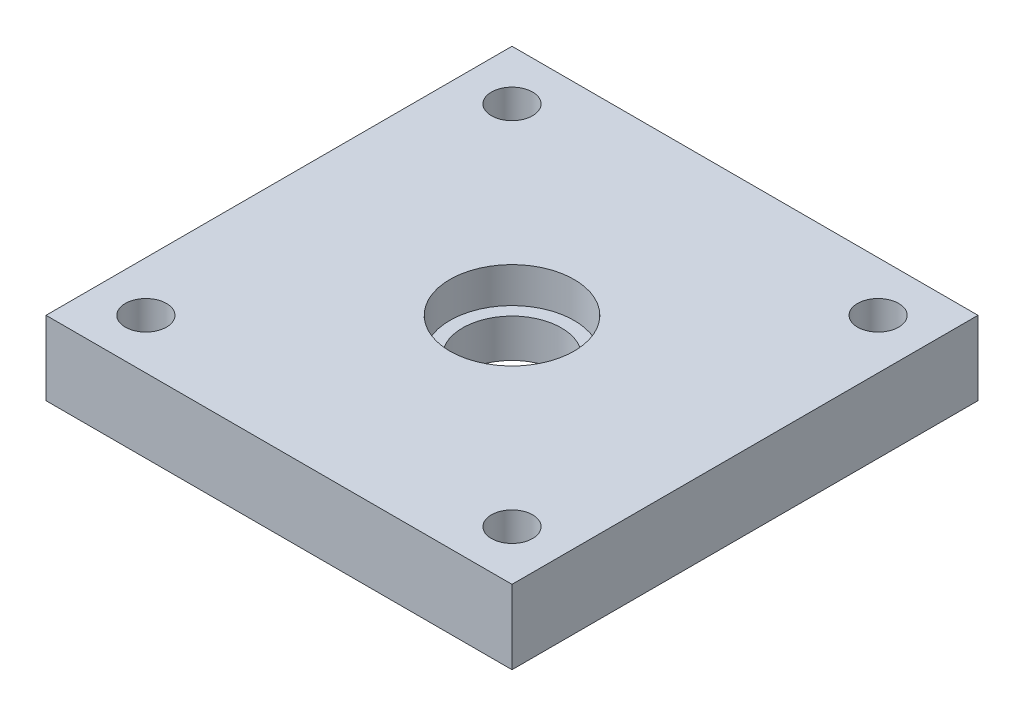
ISO-10303-21;
HEADER;
FILE_DESCRIPTION(('STEP AP214'),'2;1');
FILE_NAME('part.step','',(''),(''),'','','');
FILE_SCHEMA(('AUTOMOTIVE_DESIGN { 1 0 10303 214 1 1 1 1 }'));
ENDSEC;
DATA;
#1=APPLICATION_CONTEXT('core data for automotive mechanical design processes');
#2=APPLICATION_PROTOCOL_DEFINITION('international standard','automotive_design',2000,#1);
#3=PRODUCT_CONTEXT('',#1,'mechanical');
#4=PRODUCT('Part','Part','',(#3));
#5=PRODUCT_RELATED_PRODUCT_CATEGORY('part','',(#4));
#6=PRODUCT_DEFINITION_FORMATION('','',#4);
#7=PRODUCT_DEFINITION_CONTEXT('part definition',#1,'design');
#8=PRODUCT_DEFINITION('design','',#6,#7);
#9=PRODUCT_DEFINITION_SHAPE('','',#8);
#10=(LENGTH_UNIT() NAMED_UNIT(*) SI_UNIT(.MILLI.,.METRE.));
#11=(NAMED_UNIT(*) PLANE_ANGLE_UNIT() SI_UNIT($,.RADIAN.));
#12=(NAMED_UNIT(*) SI_UNIT($,.STERADIAN.) SOLID_ANGLE_UNIT());
#13=UNCERTAINTY_MEASURE_WITH_UNIT(LENGTH_MEASURE(1.E-05),#10,'distance_accuracy_value','');
#14=(GEOMETRIC_REPRESENTATION_CONTEXT(3) GLOBAL_UNCERTAINTY_ASSIGNED_CONTEXT((#13)) GLOBAL_UNIT_ASSIGNED_CONTEXT((#10,
#11,#12)) REPRESENTATION_CONTEXT('',''));
#15=CARTESIAN_POINT('',(0.,0.,0.));
#16=DIRECTION('',(0.,0.,1.));
#17=DIRECTION('',(1.,0.,0.));
#18=AXIS2_PLACEMENT_3D('',#15,#16,#17);
#19=CARTESIAN_POINT('',(30.,9.525,-30.));
#20=DIRECTION('',(-1.,0.,0.));
#21=DIRECTION('',(0.,0.,1.));
#22=AXIS2_PLACEMENT_3D('',#19,#20,#21);
#23=PLANE('',#22);
#24=DIRECTION('',(0.,0.,-1.));
#25=VECTOR('',#24,1.);
#26=CARTESIAN_POINT('',(30.,0.,-30.));
#27=LINE('',#26,#25);
#28=CARTESIAN_POINT('',(30.,0.,30.));
#29=VERTEX_POINT('',#28);
#30=CARTESIAN_POINT('',(30.,0.,-30.));
#31=VERTEX_POINT('',#30);
#32=EDGE_CURVE('E95',#29,#31,#27,.T.);
#33=ORIENTED_EDGE('',*,*,#32,.T.);
#34=DIRECTION('',(0.,-1.,0.));
#35=VECTOR('',#34,1.);
#36=CARTESIAN_POINT('',(30.,9.525,-30.));
#37=LINE('',#36,#35);
#38=CARTESIAN_POINT('',(30.,9.525,-30.));
#39=VERTEX_POINT('',#38);
#40=EDGE_CURVE('E11',#39,#31,#37,.T.);
#41=ORIENTED_EDGE('',*,*,#40,.F.);
#42=DIRECTION('',(0.,0.,-1.));
#43=VECTOR('',#42,1.);
#44=CARTESIAN_POINT('',(30.,9.525,-30.));
#45=LINE('',#44,#43);
#46=CARTESIAN_POINT('',(30.,9.525,30.));
#47=VERTEX_POINT('',#46);
#48=EDGE_CURVE('E83',#47,#39,#45,.T.);
#49=ORIENTED_EDGE('',*,*,#48,.F.);
#50=DIRECTION('',(0.,-1.,0.));
#51=VECTOR('',#50,1.);
#52=CARTESIAN_POINT('',(30.,9.525,30.));
#53=LINE('',#52,#51);
#54=EDGE_CURVE('E91',#47,#29,#53,.T.);
#55=ORIENTED_EDGE('',*,*,#54,.T.);
#56=EDGE_LOOP('',(#33,#41,#49,#55));
#57=FACE_BOUND('',#56,.T.);
#58=ADVANCED_FACE('F32',(#57),#23,.F.);
#59=CARTESIAN_POINT('',(-30.,9.525,-30.));
#60=DIRECTION('',(0.,0.,1.));
#61=DIRECTION('',(1.,0.,0.));
#62=AXIS2_PLACEMENT_3D('',#59,#60,#61);
#63=PLANE('',#62);
#64=DIRECTION('',(-1.,0.,0.));
#65=VECTOR('',#64,1.);
#66=CARTESIAN_POINT('',(-30.,0.,-30.));
#67=LINE('',#66,#65);
#68=CARTESIAN_POINT('',(-30.,0.,-30.));
#69=VERTEX_POINT('',#68);
#70=EDGE_CURVE('E87',#31,#69,#67,.T.);
#71=ORIENTED_EDGE('',*,*,#70,.T.);
#72=DIRECTION('',(0.,-1.,0.));
#73=VECTOR('',#72,1.);
#74=CARTESIAN_POINT('',(-30.,9.525,-30.));
#75=LINE('',#74,#73);
#76=CARTESIAN_POINT('',(-30.,9.525,-30.));
#77=VERTEX_POINT('',#76);
#78=EDGE_CURVE('E40',#77,#69,#75,.T.);
#79=ORIENTED_EDGE('',*,*,#78,.F.);
#80=DIRECTION('',(-1.,0.,0.));
#81=VECTOR('',#80,1.);
#82=CARTESIAN_POINT('',(-30.,9.525,-30.));
#83=LINE('',#82,#81);
#84=EDGE_CURVE('E78',#39,#77,#83,.T.);
#85=ORIENTED_EDGE('',*,*,#84,.F.);
#86=ORIENTED_EDGE('',*,*,#40,.T.);
#87=EDGE_LOOP('',(#71,#79,#85,#86));
#88=FACE_BOUND('',#87,.T.);
#89=ADVANCED_FACE('F86',(#88),#63,.F.);
#90=CARTESIAN_POINT('',(-30.,9.525,-30.));
#91=DIRECTION('',(1.,0.,0.));
#92=DIRECTION('',(0.,0.,-1.));
#93=AXIS2_PLACEMENT_3D('',#90,#91,#92);
#94=PLANE('',#93);
#95=DIRECTION('',(0.,0.,1.));
#96=VECTOR('',#95,1.);
#97=CARTESIAN_POINT('',(-30.,0.,-30.));
#98=LINE('',#97,#96);
#99=CARTESIAN_POINT('',(-30.,0.,30.));
#100=VERTEX_POINT('',#99);
#101=EDGE_CURVE('E65',#69,#100,#98,.T.);
#102=ORIENTED_EDGE('',*,*,#101,.T.);
#103=DIRECTION('',(0.,-1.,0.));
#104=VECTOR('',#103,1.);
#105=CARTESIAN_POINT('',(-30.,9.525,30.));
#106=LINE('',#105,#104);
#107=CARTESIAN_POINT('',(-30.,9.525,30.));
#108=VERTEX_POINT('',#107);
#109=EDGE_CURVE('E88',#108,#100,#106,.T.);
#110=ORIENTED_EDGE('',*,*,#109,.F.);
#111=DIRECTION('',(0.,0.,1.));
#112=VECTOR('',#111,1.);
#113=CARTESIAN_POINT('',(-30.,9.525,-30.));
#114=LINE('',#113,#112);
#115=EDGE_CURVE('E81',#77,#108,#114,.T.);
#116=ORIENTED_EDGE('',*,*,#115,.F.);
#117=ORIENTED_EDGE('',*,*,#78,.T.);
#118=EDGE_LOOP('',(#102,#110,#116,#117));
#119=FACE_BOUND('',#118,.T.);
#120=ADVANCED_FACE('F89',(#119),#94,.F.);
#121=CARTESIAN_POINT('',(-30.,9.525,30.));
#122=DIRECTION('',(0.,0.,-1.));
#123=DIRECTION('',(-1.,0.,0.));
#124=AXIS2_PLACEMENT_3D('',#121,#122,#123);
#125=PLANE('',#124);
#126=DIRECTION('',(1.,0.,0.));
#127=VECTOR('',#126,1.);
#128=CARTESIAN_POINT('',(-30.,0.,30.));
#129=LINE('',#128,#127);
#130=EDGE_CURVE('E71',#100,#29,#129,.T.);
#131=ORIENTED_EDGE('',*,*,#130,.T.);
#132=ORIENTED_EDGE('',*,*,#54,.F.);
#133=DIRECTION('',(1.,0.,0.));
#134=VECTOR('',#133,1.);
#135=CARTESIAN_POINT('',(-30.,9.525,30.));
#136=LINE('',#135,#134);
#137=EDGE_CURVE('E48',#108,#47,#136,.T.);
#138=ORIENTED_EDGE('',*,*,#137,.F.);
#139=ORIENTED_EDGE('',*,*,#109,.T.);
#140=EDGE_LOOP('',(#131,#132,#138,#139));
#141=FACE_BOUND('',#140,.T.);
#142=ADVANCED_FACE('F103',(#141),#125,.F.);
#143=CARTESIAN_POINT('',(0.,9.525,0.));
#144=DIRECTION('',(0.,1.,0.));
#145=DIRECTION('',(0.,0.,1.));
#146=AXIS2_PLACEMENT_3D('',#143,#144,#145);
#147=PLANE('',#146);
#148=CARTESIAN_POINT('',(0.,9.525,0.));
#149=DIRECTION('',(0.,1.,0.));
#150=DIRECTION('',(0.,0.,1.));
#151=AXIS2_PLACEMENT_3D('',#148,#149,#150);
#152=CIRCLE('',#151,8.);
#153=CARTESIAN_POINT('',(0.,9.525,8.));
#154=VERTEX_POINT('',#153);
#155=EDGE_CURVE('E133',#154,#154,#152,.T.);
#156=ORIENTED_EDGE('',*,*,#155,.F.);
#157=EDGE_LOOP('',(#156));
#158=FACE_BOUND('',#157,.T.);
#159=CARTESIAN_POINT('',(-23.57,9.525,-23.57));
#160=DIRECTION('',(0.,1.,0.));
#161=DIRECTION('',(0.,0.,1.));
#162=AXIS2_PLACEMENT_3D('',#159,#160,#161);
#163=CIRCLE('',#162,2.65);
#164=CARTESIAN_POINT('',(-23.57,9.525,-20.92));
#165=VERTEX_POINT('',#164);
#166=EDGE_CURVE('E129',#165,#165,#163,.T.);
#167=ORIENTED_EDGE('',*,*,#166,.F.);
#168=EDGE_LOOP('',(#167));
#169=FACE_BOUND('',#168,.T.);
#170=CARTESIAN_POINT('',(23.57,9.525,-23.57));
#171=DIRECTION('',(0.,1.,0.));
#172=DIRECTION('',(0.,0.,1.));
#173=AXIS2_PLACEMENT_3D('',#170,#171,#172);
#174=CIRCLE('',#173,2.65);
#175=CARTESIAN_POINT('',(23.57,9.525,-20.92));
#176=VERTEX_POINT('',#175);
#177=EDGE_CURVE('E123',#176,#176,#174,.T.);
#178=ORIENTED_EDGE('',*,*,#177,.F.);
#179=EDGE_LOOP('',(#178));
#180=FACE_BOUND('',#179,.T.);
#181=CARTESIAN_POINT('',(23.57,9.525,23.57));
#182=DIRECTION('',(0.,1.,0.));
#183=DIRECTION('',(0.,0.,1.));
#184=AXIS2_PLACEMENT_3D('',#181,#182,#183);
#185=CIRCLE('',#184,2.65);
#186=CARTESIAN_POINT('',(23.57,9.525,26.22));
#187=VERTEX_POINT('',#186);
#188=EDGE_CURVE('E117',#187,#187,#185,.T.);
#189=ORIENTED_EDGE('',*,*,#188,.F.);
#190=EDGE_LOOP('',(#189));
#191=FACE_BOUND('',#190,.T.);
#192=CARTESIAN_POINT('',(-23.57,9.525,23.57));
#193=DIRECTION('',(0.,1.,0.));
#194=DIRECTION('',(0.,0.,1.));
#195=AXIS2_PLACEMENT_3D('',#192,#193,#194);
#196=CIRCLE('',#195,2.65);
#197=CARTESIAN_POINT('',(-23.57,9.525,26.22));
#198=VERTEX_POINT('',#197);
#199=EDGE_CURVE('E111',#198,#198,#196,.T.);
#200=ORIENTED_EDGE('',*,*,#199,.F.);
#201=EDGE_LOOP('',(#200));
#202=FACE_BOUND('',#201,.T.);
#203=ORIENTED_EDGE('',*,*,#48,.T.);
#204=ORIENTED_EDGE('',*,*,#84,.T.);
#205=ORIENTED_EDGE('',*,*,#115,.T.);
#206=ORIENTED_EDGE('',*,*,#137,.T.);
#207=EDGE_LOOP('',(#203,#204,#205,#206));
#208=FACE_BOUND('',#207,.T.);
#209=ADVANCED_FACE('F79',(#158,#169,#180,#191,#202,#208),#147,.T.);
#210=CARTESIAN_POINT('',(0.,0.,0.));
#211=DIRECTION('',(0.,1.,0.));
#212=DIRECTION('',(0.,0.,1.));
#213=AXIS2_PLACEMENT_3D('',#210,#211,#212);
#214=PLANE('',#213);
#215=CARTESIAN_POINT('',(0.,0.,0.));
#216=DIRECTION('',(0.,1.,0.));
#217=DIRECTION('',(0.,0.,1.));
#218=AXIS2_PLACEMENT_3D('',#215,#216,#217);
#219=CIRCLE('',#218,6.35);
#220=CARTESIAN_POINT('',(0.,0.,6.35));
#221=VERTEX_POINT('',#220);
#222=EDGE_CURVE('E136',#221,#221,#219,.T.);
#223=ORIENTED_EDGE('',*,*,#222,.T.);
#224=EDGE_LOOP('',(#223));
#225=FACE_BOUND('',#224,.T.);
#226=CARTESIAN_POINT('',(-23.57,0.,-23.57));
#227=DIRECTION('',(0.,1.,0.));
#228=DIRECTION('',(0.,0.,1.));
#229=AXIS2_PLACEMENT_3D('',#226,#227,#228);
#230=CIRCLE('',#229,2.65);
#231=CARTESIAN_POINT('',(-23.57,0.,-20.92));
#232=VERTEX_POINT('',#231);
#233=EDGE_CURVE('E126',#232,#232,#230,.T.);
#234=ORIENTED_EDGE('',*,*,#233,.T.);
#235=EDGE_LOOP('',(#234));
#236=FACE_BOUND('',#235,.T.);
#237=CARTESIAN_POINT('',(23.57,0.,-23.57));
#238=DIRECTION('',(0.,1.,0.));
#239=DIRECTION('',(0.,0.,1.));
#240=AXIS2_PLACEMENT_3D('',#237,#238,#239);
#241=CIRCLE('',#240,2.65);
#242=CARTESIAN_POINT('',(23.57,0.,-20.92));
#243=VERTEX_POINT('',#242);
#244=EDGE_CURVE('E120',#243,#243,#241,.T.);
#245=ORIENTED_EDGE('',*,*,#244,.T.);
#246=EDGE_LOOP('',(#245));
#247=FACE_BOUND('',#246,.T.);
#248=CARTESIAN_POINT('',(23.57,0.,23.57));
#249=DIRECTION('',(0.,1.,0.));
#250=DIRECTION('',(0.,0.,1.));
#251=AXIS2_PLACEMENT_3D('',#248,#249,#250);
#252=CIRCLE('',#251,2.65);
#253=CARTESIAN_POINT('',(23.57,0.,26.22));
#254=VERTEX_POINT('',#253);
#255=EDGE_CURVE('E114',#254,#254,#252,.T.);
#256=ORIENTED_EDGE('',*,*,#255,.T.);
#257=EDGE_LOOP('',(#256));
#258=FACE_BOUND('',#257,.T.);
#259=CARTESIAN_POINT('',(-23.57,0.,23.57));
#260=DIRECTION('',(0.,1.,0.));
#261=DIRECTION('',(0.,0.,1.));
#262=AXIS2_PLACEMENT_3D('',#259,#260,#261);
#263=CIRCLE('',#262,2.65);
#264=CARTESIAN_POINT('',(-23.57,0.,26.22));
#265=VERTEX_POINT('',#264);
#266=EDGE_CURVE('E98',#265,#265,#263,.T.);
#267=ORIENTED_EDGE('',*,*,#266,.T.);
#268=EDGE_LOOP('',(#267));
#269=FACE_BOUND('',#268,.T.);
#270=ORIENTED_EDGE('',*,*,#32,.F.);
#271=ORIENTED_EDGE('',*,*,#130,.F.);
#272=ORIENTED_EDGE('',*,*,#101,.F.);
#273=ORIENTED_EDGE('',*,*,#70,.F.);
#274=EDGE_LOOP('',(#270,#271,#272,#273));
#275=FACE_BOUND('',#274,.T.);
#276=ADVANCED_FACE('F106',(#225,#236,#247,#258,#269,#275),#214,.F.);
#277=CARTESIAN_POINT('',(-23.57,9.525,23.57));
#278=DIRECTION('',(0.,1.,0.));
#279=DIRECTION('',(0.,0.,1.));
#280=AXIS2_PLACEMENT_3D('',#277,#278,#279);
#281=CYLINDRICAL_SURFACE('',#280,2.65);
#282=ORIENTED_EDGE('',*,*,#266,.F.);
#283=EDGE_LOOP('',(#282));
#284=FACE_BOUND('',#283,.T.);
#285=ORIENTED_EDGE('',*,*,#199,.T.);
#286=EDGE_LOOP('',(#285));
#287=FACE_BOUND('',#286,.T.);
#288=ADVANCED_FACE('F177',(#284,#287),#281,.F.);
#289=CARTESIAN_POINT('',(23.57,9.525,23.57));
#290=DIRECTION('',(0.,1.,0.));
#291=DIRECTION('',(0.,0.,1.));
#292=AXIS2_PLACEMENT_3D('',#289,#290,#291);
#293=CYLINDRICAL_SURFACE('',#292,2.65);
#294=ORIENTED_EDGE('',*,*,#255,.F.);
#295=EDGE_LOOP('',(#294));
#296=FACE_BOUND('',#295,.T.);
#297=ORIENTED_EDGE('',*,*,#188,.T.);
#298=EDGE_LOOP('',(#297));
#299=FACE_BOUND('',#298,.T.);
#300=ADVANCED_FACE('F179',(#296,#299),#293,.F.);
#301=CARTESIAN_POINT('',(23.57,9.525,-23.57));
#302=DIRECTION('',(0.,1.,0.));
#303=DIRECTION('',(0.,0.,1.));
#304=AXIS2_PLACEMENT_3D('',#301,#302,#303);
#305=CYLINDRICAL_SURFACE('',#304,2.65);
#306=ORIENTED_EDGE('',*,*,#244,.F.);
#307=EDGE_LOOP('',(#306));
#308=FACE_BOUND('',#307,.T.);
#309=ORIENTED_EDGE('',*,*,#177,.T.);
#310=EDGE_LOOP('',(#309));
#311=FACE_BOUND('',#310,.T.);
#312=ADVANCED_FACE('F186',(#308,#311),#305,.F.);
#313=CARTESIAN_POINT('',(-23.57,9.525,-23.57));
#314=DIRECTION('',(0.,1.,0.));
#315=DIRECTION('',(0.,0.,1.));
#316=AXIS2_PLACEMENT_3D('',#313,#314,#315);
#317=CYLINDRICAL_SURFACE('',#316,2.65);
#318=ORIENTED_EDGE('',*,*,#233,.F.);
#319=EDGE_LOOP('',(#318));
#320=FACE_BOUND('',#319,.T.);
#321=ORIENTED_EDGE('',*,*,#166,.T.);
#322=EDGE_LOOP('',(#321));
#323=FACE_BOUND('',#322,.T.);
#324=ADVANCED_FACE('F162',(#320,#323),#317,.F.);
#325=CARTESIAN_POINT('',(0.,4.953,0.));
#326=DIRECTION('',(0.,1.,0.));
#327=DIRECTION('',(0.,0.,1.));
#328=AXIS2_PLACEMENT_3D('',#325,#326,#327);
#329=CYLINDRICAL_SURFACE('',#328,8.);
#330=CARTESIAN_POINT('',(0.,4.953,0.));
#331=DIRECTION('',(0.,1.,0.));
#332=DIRECTION('',(0.,0.,1.));
#333=AXIS2_PLACEMENT_3D('',#330,#331,#332);
#334=CIRCLE('',#333,8.);
#335=CARTESIAN_POINT('',(0.,4.953,8.));
#336=VERTEX_POINT('',#335);
#337=EDGE_CURVE('E132',#336,#336,#334,.T.);
#338=ORIENTED_EDGE('',*,*,#337,.F.);
#339=EDGE_LOOP('',(#338));
#340=FACE_BOUND('',#339,.T.);
#341=ORIENTED_EDGE('',*,*,#155,.T.);
#342=EDGE_LOOP('',(#341));
#343=FACE_BOUND('',#342,.T.);
#344=ADVANCED_FACE('F156',(#340,#343),#329,.F.);
#345=CARTESIAN_POINT('',(0.,4.953,0.));
#346=DIRECTION('',(0.,1.,0.));
#347=DIRECTION('',(0.,0.,1.));
#348=AXIS2_PLACEMENT_3D('',#345,#346,#347);
#349=PLANE('',#348);
#350=CARTESIAN_POINT('',(0.,4.953,0.));
#351=DIRECTION('',(0.,1.,0.));
#352=DIRECTION('',(0.,0.,1.));
#353=AXIS2_PLACEMENT_3D('',#350,#351,#352);
#354=CIRCLE('',#353,6.35);
#355=CARTESIAN_POINT('',(0.,4.953,6.35));
#356=VERTEX_POINT('',#355);
#357=EDGE_CURVE('E139',#356,#356,#354,.T.);
#358=ORIENTED_EDGE('',*,*,#357,.F.);
#359=EDGE_LOOP('',(#358));
#360=FACE_BOUND('',#359,.T.);
#361=ORIENTED_EDGE('',*,*,#337,.T.);
#362=EDGE_LOOP('',(#361));
#363=FACE_BOUND('',#362,.T.);
#364=ADVANCED_FACE('F150',(#360,#363),#349,.T.);
#365=CARTESIAN_POINT('',(0.,0.,0.));
#366=DIRECTION('',(0.,1.,0.));
#367=DIRECTION('',(0.,0.,1.));
#368=AXIS2_PLACEMENT_3D('',#365,#366,#367);
#369=CYLINDRICAL_SURFACE('',#368,6.35);
#370=ORIENTED_EDGE('',*,*,#222,.F.);
#371=EDGE_LOOP('',(#370));
#372=FACE_BOUND('',#371,.T.);
#373=ORIENTED_EDGE('',*,*,#357,.T.);
#374=EDGE_LOOP('',(#373));
#375=FACE_BOUND('',#374,.T.);
#376=ADVANCED_FACE('F147',(#372,#375),#369,.F.);
#377=CLOSED_SHELL('',(#58,#89,#120,#142,#209,#276,#288,#300,#312,#324,#344,#364,#376));
#378=MANIFOLD_SOLID_BREP('B2',#377);
#379=ADVANCED_BREP_SHAPE_REPRESENTATION('',(#18,#378),#14);
#380=SHAPE_DEFINITION_REPRESENTATION(#9,#379);
ENDSEC;
END-ISO-10303-21;
